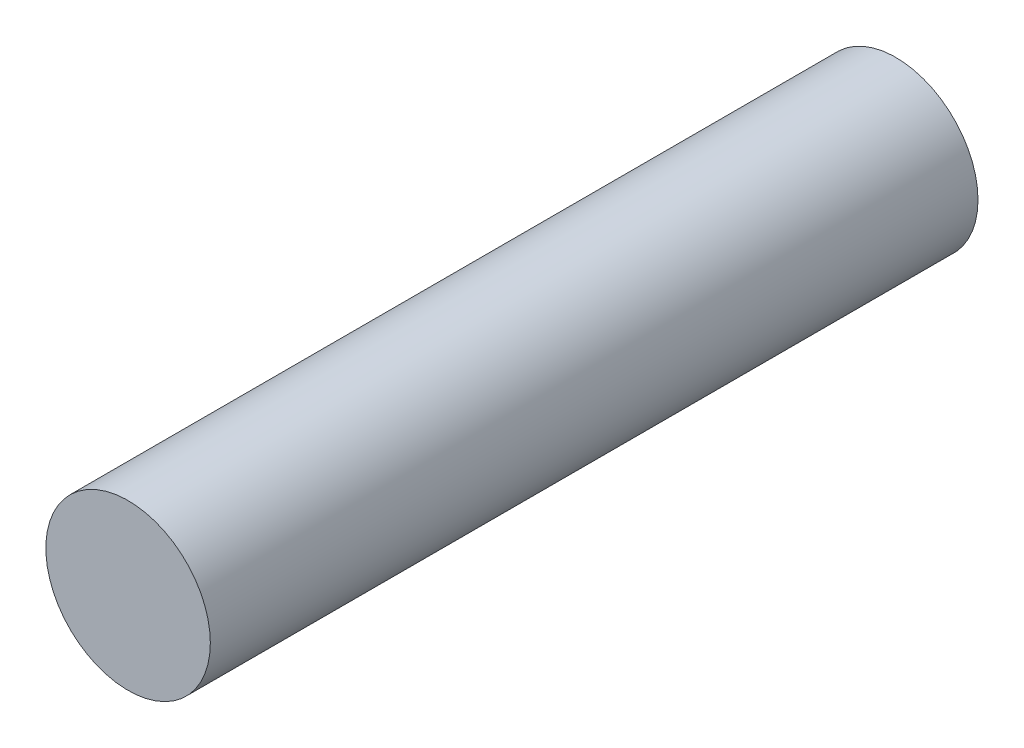
ISO-10303-21;
HEADER;
FILE_DESCRIPTION(('STEP AP214'),'2;1');
FILE_NAME('part.step','',(''),(''),'','','');
FILE_SCHEMA(('AUTOMOTIVE_DESIGN { 1 0 10303 214 1 1 1 1 }'));
ENDSEC;
DATA;
#1=APPLICATION_CONTEXT('core data for automotive mechanical design processes');
#2=APPLICATION_PROTOCOL_DEFINITION('international standard','automotive_design',2000,#1);
#3=PRODUCT_CONTEXT('',#1,'mechanical');
#4=PRODUCT('Part','Part','',(#3));
#5=PRODUCT_RELATED_PRODUCT_CATEGORY('part','',(#4));
#6=PRODUCT_DEFINITION_FORMATION('','',#4);
#7=PRODUCT_DEFINITION_CONTEXT('part definition',#1,'design');
#8=PRODUCT_DEFINITION('design','',#6,#7);
#9=PRODUCT_DEFINITION_SHAPE('','',#8);
#10=(LENGTH_UNIT() NAMED_UNIT(*) SI_UNIT(.MILLI.,.METRE.));
#11=(NAMED_UNIT(*) PLANE_ANGLE_UNIT() SI_UNIT($,.RADIAN.));
#12=(NAMED_UNIT(*) SI_UNIT($,.STERADIAN.) SOLID_ANGLE_UNIT());
#13=UNCERTAINTY_MEASURE_WITH_UNIT(LENGTH_MEASURE(1.E-05),#10,'distance_accuracy_value','');
#14=(GEOMETRIC_REPRESENTATION_CONTEXT(3) GLOBAL_UNCERTAINTY_ASSIGNED_CONTEXT((#13)) GLOBAL_UNIT_ASSIGNED_CONTEXT((#10,
#11,#12)) REPRESENTATION_CONTEXT('',''));
#15=CARTESIAN_POINT('',(0.,0.,0.));
#16=DIRECTION('',(0.,0.,1.));
#17=DIRECTION('',(1.,0.,0.));
#18=AXIS2_PLACEMENT_3D('',#15,#16,#17);
#19=CARTESIAN_POINT('',(0.,0.,44.45));
#20=DIRECTION('',(0.,0.,-1.));
#21=DIRECTION('',(-1.,0.,0.));
#22=AXIS2_PLACEMENT_3D('',#19,#20,#21);
#23=CYLINDRICAL_SURFACE('',#22,4.7625);
#24=CARTESIAN_POINT('',(0.,0.,44.45));
#25=DIRECTION('',(0.,0.,1.));
#26=DIRECTION('',(1.,0.,0.));
#27=AXIS2_PLACEMENT_3D('',#24,#25,#26);
#28=CIRCLE('',#27,4.7625);
#29=CARTESIAN_POINT('',(4.7625,0.,44.45));
#30=VERTEX_POINT('',#29);
#31=EDGE_CURVE('E10',#30,#30,#28,.T.);
#32=ORIENTED_EDGE('',*,*,#31,.F.);
#33=EDGE_LOOP('',(#32));
#34=FACE_BOUND('',#33,.T.);
#35=CARTESIAN_POINT('',(0.,0.,0.));
#36=DIRECTION('',(0.,0.,1.));
#37=DIRECTION('',(1.,0.,0.));
#38=AXIS2_PLACEMENT_3D('',#35,#36,#37);
#39=CIRCLE('',#38,4.7625);
#40=CARTESIAN_POINT('',(4.7625,0.,0.));
#41=VERTEX_POINT('',#40);
#42=EDGE_CURVE('E36',#41,#41,#39,.T.);
#43=ORIENTED_EDGE('',*,*,#42,.T.);
#44=EDGE_LOOP('',(#43));
#45=FACE_BOUND('',#44,.T.);
#46=ADVANCED_FACE('F33',(#34,#45),#23,.T.);
#47=CARTESIAN_POINT('',(0.,0.,44.45));
#48=DIRECTION('',(0.,0.,1.));
#49=DIRECTION('',(1.,0.,0.));
#50=AXIS2_PLACEMENT_3D('',#47,#48,#49);
#51=PLANE('',#50);
#52=ORIENTED_EDGE('',*,*,#31,.T.);
#53=EDGE_LOOP('',(#52));
#54=FACE_BOUND('',#53,.T.);
#55=ADVANCED_FACE('F48',(#54),#51,.T.);
#56=CARTESIAN_POINT('',(0.,0.,0.));
#57=DIRECTION('',(0.,0.,1.));
#58=DIRECTION('',(1.,0.,0.));
#59=AXIS2_PLACEMENT_3D('',#56,#57,#58);
#60=PLANE('',#59);
#61=ORIENTED_EDGE('',*,*,#42,.F.);
#62=EDGE_LOOP('',(#61));
#63=FACE_BOUND('',#62,.T.);
#64=ADVANCED_FACE('F46',(#63),#60,.F.);
#65=CLOSED_SHELL('',(#46,#55,#64));
#66=MANIFOLD_SOLID_BREP('B2',#65);
#67=ADVANCED_BREP_SHAPE_REPRESENTATION('',(#18,#66),#14);
#68=SHAPE_DEFINITION_REPRESENTATION(#9,#67);
ENDSEC;
END-ISO-10303-21;
